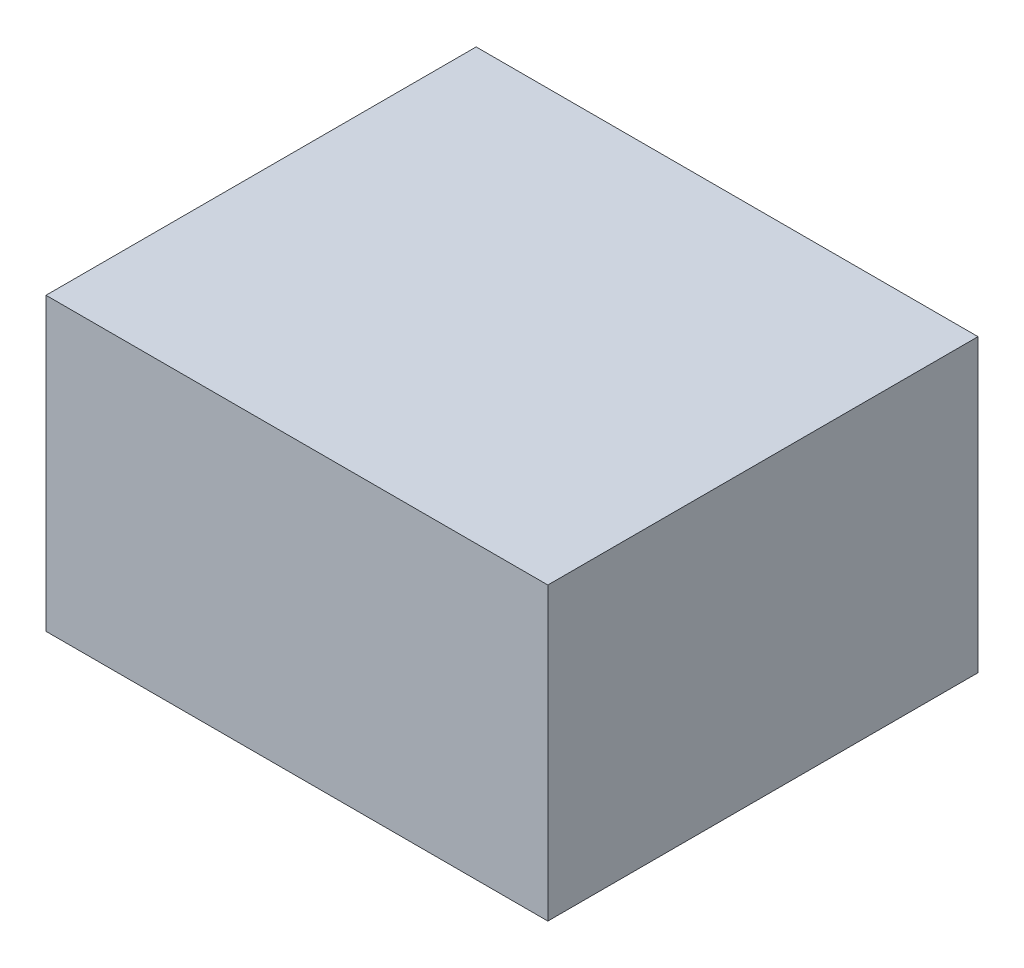
ISO-10303-21;
HEADER;
FILE_DESCRIPTION(('STEP AP214'),'2;1');
FILE_NAME('part.step','',(''),(''),'','','');
FILE_SCHEMA(('AUTOMOTIVE_DESIGN { 1 0 10303 214 1 1 1 1 }'));
ENDSEC;
DATA;
#1=APPLICATION_CONTEXT('core data for automotive mechanical design processes');
#2=APPLICATION_PROTOCOL_DEFINITION('international standard','automotive_design',2000,#1);
#3=PRODUCT_CONTEXT('',#1,'mechanical');
#4=PRODUCT('Part','Part','',(#3));
#5=PRODUCT_RELATED_PRODUCT_CATEGORY('part','',(#4));
#6=PRODUCT_DEFINITION_FORMATION('','',#4);
#7=PRODUCT_DEFINITION_CONTEXT('part definition',#1,'design');
#8=PRODUCT_DEFINITION('design','',#6,#7);
#9=PRODUCT_DEFINITION_SHAPE('','',#8);
#10=(LENGTH_UNIT() NAMED_UNIT(*) SI_UNIT(.MILLI.,.METRE.));
#11=(NAMED_UNIT(*) PLANE_ANGLE_UNIT() SI_UNIT($,.RADIAN.));
#12=(NAMED_UNIT(*) SI_UNIT($,.STERADIAN.) SOLID_ANGLE_UNIT());
#13=UNCERTAINTY_MEASURE_WITH_UNIT(LENGTH_MEASURE(1.E-05),#10,'distance_accuracy_value','');
#14=(GEOMETRIC_REPRESENTATION_CONTEXT(3) GLOBAL_UNCERTAINTY_ASSIGNED_CONTEXT((#13)) GLOBAL_UNIT_ASSIGNED_CONTEXT((#10,
#11,#12)) REPRESENTATION_CONTEXT('',''));
#15=CARTESIAN_POINT('',(0.,0.,0.));
#16=DIRECTION('',(0.,0.,1.));
#17=DIRECTION('',(1.,0.,0.));
#18=AXIS2_PLACEMENT_3D('',#15,#16,#17);
#19=CARTESIAN_POINT('',(-0.14999999999999,0.475,1.025));
#20=DIRECTION('',(0.,0.,-1.));
#21=DIRECTION('',(-1.,0.,0.));
#22=AXIS2_PLACEMENT_3D('',#19,#20,#21);
#23=PLANE('',#22);
#24=DIRECTION('',(1.,0.,0.));
#25=VECTOR('',#24,1.);
#26=CARTESIAN_POINT('',(-0.14999999999999,0.272,1.025));
#27=LINE('',#26,#25);
#28=CARTESIAN_POINT('',(-0.14999999999999,0.272,1.025));
#29=VERTEX_POINT('',#28);
#30=CARTESIAN_POINT('',(0.200000000000011,0.272,1.025));
#31=VERTEX_POINT('',#30);
#32=EDGE_CURVE('E11',#29,#31,#27,.T.);
#33=ORIENTED_EDGE('',*,*,#32,.T.);
#34=DIRECTION('',(0.,-1.,0.));
#35=VECTOR('',#34,1.);
#36=CARTESIAN_POINT('',(0.200000000000011,0.475,1.025));
#37=LINE('',#36,#35);
#38=CARTESIAN_POINT('',(0.200000000000011,0.475,1.025));
#39=VERTEX_POINT('',#38);
#40=EDGE_CURVE('E24',#39,#31,#37,.T.);
#41=ORIENTED_EDGE('',*,*,#40,.F.);
#42=DIRECTION('',(1.,0.,0.));
#43=VECTOR('',#42,1.);
#44=CARTESIAN_POINT('',(-0.14999999999999,0.475,1.025));
#45=LINE('',#44,#43);
#46=CARTESIAN_POINT('',(-0.14999999999999,0.475,1.025));
#47=VERTEX_POINT('',#46);
#48=EDGE_CURVE('E88',#47,#39,#45,.T.);
#49=ORIENTED_EDGE('',*,*,#48,.F.);
#50=DIRECTION('',(0.,-1.,0.));
#51=VECTOR('',#50,1.);
#52=CARTESIAN_POINT('',(-0.14999999999999,0.475,1.025));
#53=LINE('',#52,#51);
#54=EDGE_CURVE('E77',#47,#29,#53,.T.);
#55=ORIENTED_EDGE('',*,*,#54,.T.);
#56=EDGE_LOOP('',(#33,#41,#49,#55));
#57=FACE_BOUND('',#56,.T.);
#58=ADVANCED_FACE('F17',(#57),#23,.F.);
#59=CARTESIAN_POINT('',(0.200000000000011,0.475,1.025));
#60=DIRECTION('',(-1.,0.,0.));
#61=DIRECTION('',(0.,0.,1.));
#62=AXIS2_PLACEMENT_3D('',#59,#60,#61);
#63=PLANE('',#62);
#64=DIRECTION('',(0.,0.,-1.));
#65=VECTOR('',#64,1.);
#66=CARTESIAN_POINT('',(0.200000000000011,0.272,1.025));
#67=LINE('',#66,#65);
#68=CARTESIAN_POINT('',(0.20000000000003,0.272,0.725000000000022));
#69=VERTEX_POINT('',#68);
#70=EDGE_CURVE('E85',#31,#69,#67,.T.);
#71=ORIENTED_EDGE('',*,*,#70,.T.);
#72=DIRECTION('',(0.,-1.,0.));
#73=VECTOR('',#72,1.);
#74=CARTESIAN_POINT('',(0.20000000000003,0.475,0.725000000000022));
#75=LINE('',#74,#73);
#76=CARTESIAN_POINT('',(0.20000000000003,0.475,0.725000000000022));
#77=VERTEX_POINT('',#76);
#78=EDGE_CURVE('E83',#77,#69,#75,.T.);
#79=ORIENTED_EDGE('',*,*,#78,.F.);
#80=DIRECTION('',(0.,0.,-1.));
#81=VECTOR('',#80,1.);
#82=CARTESIAN_POINT('',(0.200000000000011,0.475,1.025));
#83=LINE('',#82,#81);
#84=EDGE_CURVE('E72',#39,#77,#83,.T.);
#85=ORIENTED_EDGE('',*,*,#84,.F.);
#86=ORIENTED_EDGE('',*,*,#40,.T.);
#87=EDGE_LOOP('',(#71,#79,#85,#86));
#88=FACE_BOUND('',#87,.T.);
#89=ADVANCED_FACE('F90',(#88),#63,.F.);
#90=CARTESIAN_POINT('',(0.20000000000003,0.475,0.725000000000022));
#91=DIRECTION('',(0.,0.,1.));
#92=DIRECTION('',(1.,0.,0.));
#93=AXIS2_PLACEMENT_3D('',#90,#91,#92);
#94=PLANE('',#93);
#95=DIRECTION('',(-1.,0.,0.));
#96=VECTOR('',#95,1.);
#97=CARTESIAN_POINT('',(0.20000000000003,0.272,0.725000000000022));
#98=LINE('',#97,#96);
#99=CARTESIAN_POINT('',(-0.149999999999971,0.272,0.725000000000006));
#100=VERTEX_POINT('',#99);
#101=EDGE_CURVE('E60',#69,#100,#98,.T.);
#102=ORIENTED_EDGE('',*,*,#101,.T.);
#103=DIRECTION('',(0.,-1.,0.));
#104=VECTOR('',#103,1.);
#105=CARTESIAN_POINT('',(-0.149999999999971,0.475,0.725000000000006));
#106=LINE('',#105,#104);
#107=CARTESIAN_POINT('',(-0.149999999999971,0.475,0.725000000000006));
#108=VERTEX_POINT('',#107);
#109=EDGE_CURVE('E54',#108,#100,#106,.T.);
#110=ORIENTED_EDGE('',*,*,#109,.F.);
#111=DIRECTION('',(-1.,0.,0.));
#112=VECTOR('',#111,1.);
#113=CARTESIAN_POINT('',(0.20000000000003,0.475,0.725000000000022));
#114=LINE('',#113,#112);
#115=EDGE_CURVE('E58',#77,#108,#114,.T.);
#116=ORIENTED_EDGE('',*,*,#115,.F.);
#117=ORIENTED_EDGE('',*,*,#78,.T.);
#118=EDGE_LOOP('',(#102,#110,#116,#117));
#119=FACE_BOUND('',#118,.T.);
#120=ADVANCED_FACE('F56',(#119),#94,.F.);
#121=CARTESIAN_POINT('',(-0.149999999999971,0.475,0.725000000000006));
#122=DIRECTION('',(1.,0.,0.));
#123=DIRECTION('',(0.,0.,-1.));
#124=AXIS2_PLACEMENT_3D('',#121,#122,#123);
#125=PLANE('',#124);
#126=DIRECTION('',(0.,0.,1.));
#127=VECTOR('',#126,1.);
#128=CARTESIAN_POINT('',(-0.149999999999971,0.272,0.725000000000006));
#129=LINE('',#128,#127);
#130=EDGE_CURVE('E73',#100,#29,#129,.T.);
#131=ORIENTED_EDGE('',*,*,#130,.T.);
#132=ORIENTED_EDGE('',*,*,#54,.F.);
#133=DIRECTION('',(0.,0.,1.));
#134=VECTOR('',#133,1.);
#135=CARTESIAN_POINT('',(-0.149999999999971,0.475,0.725000000000006));
#136=LINE('',#135,#134);
#137=EDGE_CURVE('E70',#108,#47,#136,.T.);
#138=ORIENTED_EDGE('',*,*,#137,.F.);
#139=ORIENTED_EDGE('',*,*,#109,.T.);
#140=EDGE_LOOP('',(#131,#132,#138,#139));
#141=FACE_BOUND('',#140,.T.);
#142=ADVANCED_FACE('F76',(#141),#125,.F.);
#143=CARTESIAN_POINT('',(0.,0.475,0.));
#144=DIRECTION('',(0.,1.,0.));
#145=DIRECTION('',(0.,0.,1.));
#146=AXIS2_PLACEMENT_3D('',#143,#144,#145);
#147=PLANE('',#146);
#148=ORIENTED_EDGE('',*,*,#48,.T.);
#149=ORIENTED_EDGE('',*,*,#84,.T.);
#150=ORIENTED_EDGE('',*,*,#115,.T.);
#151=ORIENTED_EDGE('',*,*,#137,.T.);
#152=EDGE_LOOP('',(#148,#149,#150,#151));
#153=FACE_BOUND('',#152,.T.);
#154=ADVANCED_FACE('F69',(#153),#147,.T.);
#155=CARTESIAN_POINT('',(0.,0.272,0.));
#156=DIRECTION('',(0.,1.,0.));
#157=DIRECTION('',(0.,0.,1.));
#158=AXIS2_PLACEMENT_3D('',#155,#156,#157);
#159=PLANE('',#158);
#160=ORIENTED_EDGE('',*,*,#32,.F.);
#161=ORIENTED_EDGE('',*,*,#130,.F.);
#162=ORIENTED_EDGE('',*,*,#101,.F.);
#163=ORIENTED_EDGE('',*,*,#70,.F.);
#164=EDGE_LOOP('',(#160,#161,#162,#163));
#165=FACE_BOUND('',#164,.T.);
#166=ADVANCED_FACE('F91',(#165),#159,.F.);
#167=CLOSED_SHELL('',(#58,#89,#120,#142,#154,#166));
#168=MANIFOLD_SOLID_BREP('B1',#167);
#169=ADVANCED_BREP_SHAPE_REPRESENTATION('',(#18,#168),#14);
#170=SHAPE_DEFINITION_REPRESENTATION(#9,#169);
ENDSEC;
END-ISO-10303-21;
